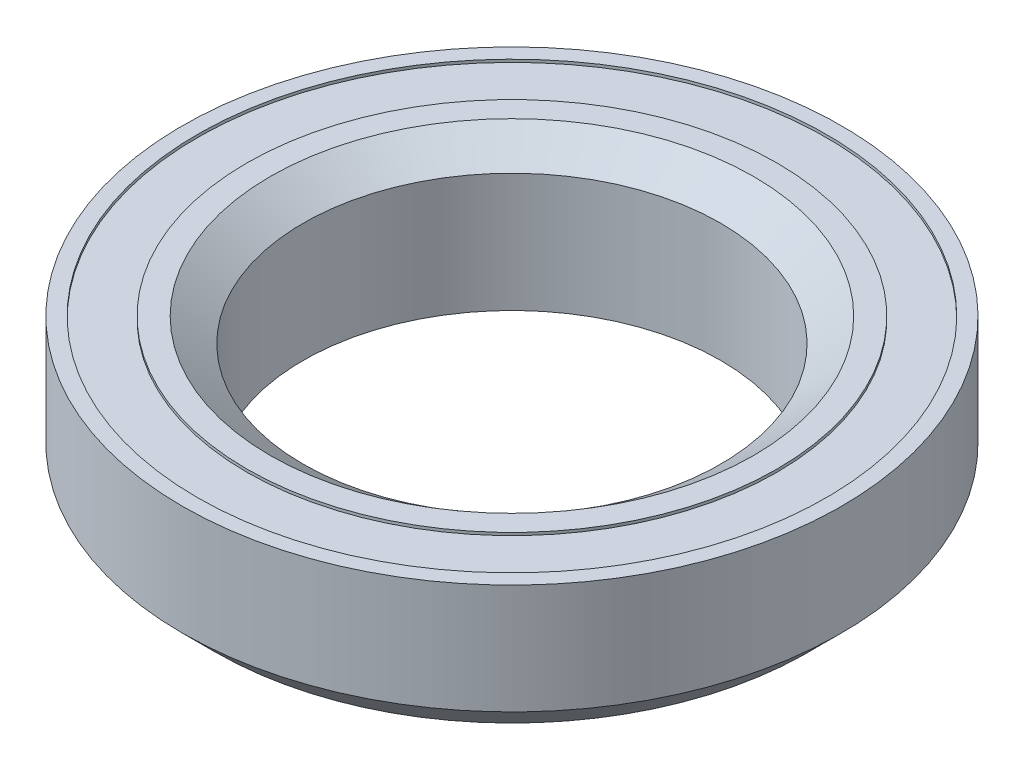
ISO-10303-21;
HEADER;
FILE_DESCRIPTION(('STEP AP214'),'2;1');
FILE_NAME('part.step','',(''),(''),'','','');
FILE_SCHEMA(('AUTOMOTIVE_DESIGN { 1 0 10303 214 1 1 1 1 }'));
ENDSEC;
DATA;
#1=APPLICATION_CONTEXT('core data for automotive mechanical design processes');
#2=APPLICATION_PROTOCOL_DEFINITION('international standard','automotive_design',2000,#1);
#3=PRODUCT_CONTEXT('',#1,'mechanical');
#4=PRODUCT('Part','Part','',(#3));
#5=PRODUCT_RELATED_PRODUCT_CATEGORY('part','',(#4));
#6=PRODUCT_DEFINITION_FORMATION('','',#4);
#7=PRODUCT_DEFINITION_CONTEXT('part definition',#1,'design');
#8=PRODUCT_DEFINITION('design','',#6,#7);
#9=PRODUCT_DEFINITION_SHAPE('','',#8);
#10=(LENGTH_UNIT() NAMED_UNIT(*) SI_UNIT(.MILLI.,.METRE.));
#11=(NAMED_UNIT(*) PLANE_ANGLE_UNIT() SI_UNIT($,.RADIAN.));
#12=(NAMED_UNIT(*) SI_UNIT($,.STERADIAN.) SOLID_ANGLE_UNIT());
#13=UNCERTAINTY_MEASURE_WITH_UNIT(LENGTH_MEASURE(1.E-05),#10,'distance_accuracy_value','');
#14=(GEOMETRIC_REPRESENTATION_CONTEXT(3) GLOBAL_UNCERTAINTY_ASSIGNED_CONTEXT((#13)) GLOBAL_UNIT_ASSIGNED_CONTEXT((#10,
#11,#12)) REPRESENTATION_CONTEXT('',''));
#15=CARTESIAN_POINT('',(0.,0.,0.));
#16=DIRECTION('',(0.,0.,1.));
#17=DIRECTION('',(1.,0.,0.));
#18=AXIS2_PLACEMENT_3D('',#15,#16,#17);
#19=CARTESIAN_POINT('',(0.,6.5,0.));
#20=DIRECTION('',(0.,1.,0.));
#21=DIRECTION('',(0.,0.,1.));
#22=AXIS2_PLACEMENT_3D('',#19,#20,#21);
#23=PLANE('',#22);
#24=CARTESIAN_POINT('',(0.,6.5,0.));
#25=DIRECTION('',(0.,1.,0.));
#26=DIRECTION('',(0.,0.,1.));
#27=AXIS2_PLACEMENT_3D('',#24,#25,#26);
#28=CIRCLE('',#27,11.);
#29=CARTESIAN_POINT('',(0.,6.5,11.));
#30=VERTEX_POINT('',#29);
#31=EDGE_CURVE('E10',#30,#30,#28,.F.);
#32=ORIENTED_EDGE('',*,*,#31,.T.);
#33=EDGE_LOOP('',(#32));
#34=FACE_BOUND('',#33,.T.);
#35=CARTESIAN_POINT('',(0.,6.5,0.));
#36=DIRECTION('',(0.,1.,0.));
#37=DIRECTION('',(0.,0.,1.));
#38=AXIS2_PLACEMENT_3D('',#35,#36,#37);
#39=CIRCLE('',#38,12.065);
#40=CARTESIAN_POINT('',(0.,6.5,12.065));
#41=VERTEX_POINT('',#40);
#42=EDGE_CURVE('E99',#41,#41,#39,.T.);
#43=ORIENTED_EDGE('',*,*,#42,.T.);
#44=EDGE_LOOP('',(#43));
#45=FACE_BOUND('',#44,.T.);
#46=ADVANCED_FACE('F41',(#34,#45),#23,.T.);
#47=CARTESIAN_POINT('',(0.,0.,0.));
#48=DIRECTION('',(0.,1.,0.));
#49=DIRECTION('',(0.,0.,1.));
#50=AXIS2_PLACEMENT_3D('',#47,#48,#49);
#51=PLANE('',#50);
#52=CARTESIAN_POINT('',(0.,0.,0.));
#53=DIRECTION('',(0.,1.,0.));
#54=DIRECTION('',(0.,0.,1.));
#55=AXIS2_PLACEMENT_3D('',#52,#53,#54);
#56=CIRCLE('',#55,9.5);
#57=CARTESIAN_POINT('',(0.,0.,9.5));
#58=VERTEX_POINT('',#57);
#59=EDGE_CURVE('E70',#58,#58,#56,.T.);
#60=ORIENTED_EDGE('',*,*,#59,.T.);
#61=EDGE_LOOP('',(#60));
#62=FACE_BOUND('',#61,.T.);
#63=CARTESIAN_POINT('',(0.,0.,0.));
#64=DIRECTION('',(0.,-1.,0.));
#65=DIRECTION('',(0.,0.,-1.));
#66=AXIS2_PLACEMENT_3D('',#63,#64,#65);
#67=CIRCLE('',#66,10.223184072359);
#68=CARTESIAN_POINT('',(0.,0.,-10.223184072359));
#69=VERTEX_POINT('',#68);
#70=EDGE_CURVE('E83',#69,#69,#67,.T.);
#71=ORIENTED_EDGE('',*,*,#70,.T.);
#72=EDGE_LOOP('',(#71));
#73=FACE_BOUND('',#72,.T.);
#74=ADVANCED_FACE('F131',(#62,#73),#51,.F.);
#75=CARTESIAN_POINT('',(0.,6.5,0.));
#76=DIRECTION('',(0.,-1.,0.));
#77=DIRECTION('',(0.,0.,-1.));
#78=AXIS2_PLACEMENT_3D('',#75,#76,#77);
#79=CYLINDRICAL_SURFACE('',#78,15.);
#80=CARTESIAN_POINT('',(0.,1.50000000000002,0.));
#81=DIRECTION('',(0.,1.,0.));
#82=DIRECTION('',(0.,0.,1.));
#83=AXIS2_PLACEMENT_3D('',#80,#81,#82);
#84=CIRCLE('',#83,15.);
#85=CARTESIAN_POINT('',(0.,1.50000000000002,15.));
#86=VERTEX_POINT('',#85);
#87=EDGE_CURVE('E60',#86,#86,#84,.T.);
#88=ORIENTED_EDGE('',*,*,#87,.T.);
#89=EDGE_LOOP('',(#88));
#90=FACE_BOUND('',#89,.T.);
#91=CARTESIAN_POINT('',(0.,6.5,0.));
#92=DIRECTION('',(0.,1.,0.));
#93=DIRECTION('',(0.,0.,1.));
#94=AXIS2_PLACEMENT_3D('',#91,#92,#93);
#95=CIRCLE('',#94,15.);
#96=CARTESIAN_POINT('',(0.,6.5,15.));
#97=VERTEX_POINT('',#96);
#98=EDGE_CURVE('E66',#97,#97,#95,.T.);
#99=ORIENTED_EDGE('',*,*,#98,.F.);
#100=EDGE_LOOP('',(#99));
#101=FACE_BOUND('',#100,.T.);
#102=ADVANCED_FACE('F126',(#90,#101),#79,.T.);
#103=CARTESIAN_POINT('',(0.,6.5,0.));
#104=DIRECTION('',(0.,1.,0.));
#105=DIRECTION('',(0.,0.,1.));
#106=AXIS2_PLACEMENT_3D('',#103,#104,#105);
#107=CIRCLE('',#106,14.3160340941404);
#108=CARTESIAN_POINT('',(0.,6.5,14.3160340941404));
#109=VERTEX_POINT('',#108);
#110=EDGE_CURVE('E91',#109,#109,#107,.T.);
#111=ORIENTED_EDGE('',*,*,#110,.F.);
#112=EDGE_LOOP('',(#111));
#113=FACE_BOUND('',#112,.T.);
#114=ORIENTED_EDGE('',*,*,#98,.T.);
#115=EDGE_LOOP('',(#114));
#116=FACE_BOUND('',#115,.T.);
#117=ADVANCED_FACE('F122',(#113,#116),#23,.T.);
#118=CARTESIAN_POINT('',(0.,0.,0.));
#119=DIRECTION('',(0.,-1.,0.));
#120=DIRECTION('',(0.,0.,-1.));
#121=AXIS2_PLACEMENT_3D('',#118,#119,#120);
#122=CIRCLE('',#121,12.8905);
#123=CARTESIAN_POINT('',(0.,0.,-12.8905));
#124=VERTEX_POINT('',#123);
#125=EDGE_CURVE('E75',#124,#124,#122,.T.);
#126=ORIENTED_EDGE('',*,*,#125,.F.);
#127=EDGE_LOOP('',(#126));
#128=FACE_BOUND('',#127,.T.);
#129=CARTESIAN_POINT('',(0.,0.,0.));
#130=DIRECTION('',(0.,1.,0.));
#131=DIRECTION('',(0.,0.,1.));
#132=AXIS2_PLACEMENT_3D('',#129,#130,#131);
#133=CIRCLE('',#132,13.5);
#134=CARTESIAN_POINT('',(0.,0.,13.5));
#135=VERTEX_POINT('',#134);
#136=EDGE_CURVE('E55',#135,#135,#133,.F.);
#137=ORIENTED_EDGE('',*,*,#136,.T.);
#138=EDGE_LOOP('',(#137));
#139=FACE_BOUND('',#138,.T.);
#140=ADVANCED_FACE('F125',(#128,#139),#51,.F.);
#141=CARTESIAN_POINT('',(0.,0.,0.));
#142=DIRECTION('',(0.,1.,0.));
#143=DIRECTION('',(0.,0.,1.));
#144=AXIS2_PLACEMENT_3D('',#141,#142,#143);
#145=CYLINDRICAL_SURFACE('',#144,9.5);
#146=CARTESIAN_POINT('',(0.,5.41018620799194,0.));
#147=DIRECTION('',(0.,1.,0.));
#148=DIRECTION('',(0.,0.,1.));
#149=AXIS2_PLACEMENT_3D('',#146,#147,#148);
#150=CIRCLE('',#149,9.5);
#151=CARTESIAN_POINT('',(0.,5.41018620799194,9.5));
#152=VERTEX_POINT('',#151);
#153=EDGE_CURVE('E49',#152,#152,#150,.T.);
#154=ORIENTED_EDGE('',*,*,#153,.T.);
#155=EDGE_LOOP('',(#154));
#156=FACE_BOUND('',#155,.T.);
#157=ORIENTED_EDGE('',*,*,#59,.F.);
#158=EDGE_LOOP('',(#157));
#159=FACE_BOUND('',#158,.T.);
#160=ADVANCED_FACE('F144',(#156,#159),#145,.F.);
#161=CARTESIAN_POINT('',(0.,1.50000000000002,0.));
#162=DIRECTION('',(0.,1.,0.));
#163=DIRECTION('',(0.,0.,1.));
#164=AXIS2_PLACEMENT_3D('',#161,#162,#163);
#165=CONICAL_SURFACE('',#164,15.,0.785398163397451);
#166=ORIENTED_EDGE('',*,*,#136,.F.);
#167=EDGE_LOOP('',(#166));
#168=FACE_BOUND('',#167,.T.);
#169=ORIENTED_EDGE('',*,*,#87,.F.);
#170=EDGE_LOOP('',(#169));
#171=FACE_BOUND('',#170,.T.);
#172=ADVANCED_FACE('F151',(#168,#171),#165,.T.);
#173=CARTESIAN_POINT('',(0.,5.41018620799194,0.));
#174=DIRECTION('',(0.,1.,0.));
#175=DIRECTION('',(0.,0.,1.));
#176=AXIS2_PLACEMENT_3D('',#173,#174,#175);
#177=CONICAL_SURFACE('',#176,9.5,0.942477796076941);
#178=ORIENTED_EDGE('',*,*,#31,.F.);
#179=EDGE_LOOP('',(#178));
#180=FACE_BOUND('',#179,.T.);
#181=ORIENTED_EDGE('',*,*,#153,.F.);
#182=EDGE_LOOP('',(#181));
#183=FACE_BOUND('',#182,.T.);
#184=ADVANCED_FACE('F43',(#180,#183),#177,.F.);
#185=CARTESIAN_POINT('',(0.,0.127,0.));
#186=DIRECTION('',(0.,-1.,0.));
#187=DIRECTION('',(0.,0.,-1.));
#188=AXIS2_PLACEMENT_3D('',#185,#186,#187);
#189=CYLINDRICAL_SURFACE('',#188,12.8905);
#190=CARTESIAN_POINT('',(0.,0.127,0.));
#191=DIRECTION('',(0.,-1.,0.));
#192=DIRECTION('',(0.,0.,-1.));
#193=AXIS2_PLACEMENT_3D('',#190,#191,#192);
#194=CIRCLE('',#193,12.8905);
#195=CARTESIAN_POINT('',(0.,0.127,-12.8905));
#196=VERTEX_POINT('',#195);
#197=EDGE_CURVE('E74',#196,#196,#194,.T.);
#198=ORIENTED_EDGE('',*,*,#197,.F.);
#199=EDGE_LOOP('',(#198));
#200=FACE_BOUND('',#199,.T.);
#201=ORIENTED_EDGE('',*,*,#125,.T.);
#202=EDGE_LOOP('',(#201));
#203=FACE_BOUND('',#202,.T.);
#204=ADVANCED_FACE('F162',(#200,#203),#189,.F.);
#205=CARTESIAN_POINT('',(0.,0.127,0.));
#206=DIRECTION('',(0.,-1.,0.));
#207=DIRECTION('',(0.,0.,-1.));
#208=AXIS2_PLACEMENT_3D('',#205,#206,#207);
#209=PLANE('',#208);
#210=CARTESIAN_POINT('',(0.,0.127,0.));
#211=DIRECTION('',(0.,-1.,0.));
#212=DIRECTION('',(0.,0.,-1.));
#213=AXIS2_PLACEMENT_3D('',#210,#211,#212);
#214=CIRCLE('',#213,10.223184072359);
#215=CARTESIAN_POINT('',(0.,0.127,-10.223184072359));
#216=VERTEX_POINT('',#215);
#217=EDGE_CURVE('E79',#216,#216,#214,.T.);
#218=ORIENTED_EDGE('',*,*,#217,.F.);
#219=EDGE_LOOP('',(#218));
#220=FACE_BOUND('',#219,.T.);
#221=ORIENTED_EDGE('',*,*,#197,.T.);
#222=EDGE_LOOP('',(#221));
#223=FACE_BOUND('',#222,.T.);
#224=ADVANCED_FACE('F167',(#220,#223),#209,.T.);
#225=CARTESIAN_POINT('',(0.,0.127,0.));
#226=DIRECTION('',(0.,-1.,0.));
#227=DIRECTION('',(0.,0.,-1.));
#228=AXIS2_PLACEMENT_3D('',#225,#226,#227);
#229=CYLINDRICAL_SURFACE('',#228,10.223184072359);
#230=ORIENTED_EDGE('',*,*,#217,.T.);
#231=EDGE_LOOP('',(#230));
#232=FACE_BOUND('',#231,.T.);
#233=ORIENTED_EDGE('',*,*,#70,.F.);
#234=EDGE_LOOP('',(#233));
#235=FACE_BOUND('',#234,.T.);
#236=ADVANCED_FACE('F118',(#232,#235),#229,.T.);
#237=CARTESIAN_POINT('',(0.,6.373,0.));
#238=DIRECTION('',(0.,1.,0.));
#239=DIRECTION('',(0.,0.,1.));
#240=AXIS2_PLACEMENT_3D('',#237,#238,#239);
#241=CYLINDRICAL_SURFACE('',#240,14.3160340941404);
#242=CARTESIAN_POINT('',(0.,6.373,0.));
#243=DIRECTION('',(0.,1.,0.));
#244=DIRECTION('',(0.,0.,1.));
#245=AXIS2_PLACEMENT_3D('',#242,#243,#244);
#246=CIRCLE('',#245,14.3160340941404);
#247=CARTESIAN_POINT('',(0.,6.373,14.3160340941404));
#248=VERTEX_POINT('',#247);
#249=EDGE_CURVE('E87',#248,#248,#246,.T.);
#250=ORIENTED_EDGE('',*,*,#249,.F.);
#251=EDGE_LOOP('',(#250));
#252=FACE_BOUND('',#251,.T.);
#253=ORIENTED_EDGE('',*,*,#110,.T.);
#254=EDGE_LOOP('',(#253));
#255=FACE_BOUND('',#254,.T.);
#256=ADVANCED_FACE('F112',(#252,#255),#241,.F.);
#257=CARTESIAN_POINT('',(0.,6.373,0.));
#258=DIRECTION('',(0.,1.,0.));
#259=DIRECTION('',(0.,0.,1.));
#260=AXIS2_PLACEMENT_3D('',#257,#258,#259);
#261=PLANE('',#260);
#262=CARTESIAN_POINT('',(0.,6.373,0.));
#263=DIRECTION('',(0.,1.,0.));
#264=DIRECTION('',(0.,0.,1.));
#265=AXIS2_PLACEMENT_3D('',#262,#263,#264);
#266=CIRCLE('',#265,12.065);
#267=CARTESIAN_POINT('',(0.,6.373,12.065));
#268=VERTEX_POINT('',#267);
#269=EDGE_CURVE('E95',#268,#268,#266,.T.);
#270=ORIENTED_EDGE('',*,*,#269,.F.);
#271=EDGE_LOOP('',(#270));
#272=FACE_BOUND('',#271,.T.);
#273=ORIENTED_EDGE('',*,*,#249,.T.);
#274=EDGE_LOOP('',(#273));
#275=FACE_BOUND('',#274,.T.);
#276=ADVANCED_FACE('F109',(#272,#275),#261,.T.);
#277=CARTESIAN_POINT('',(0.,6.373,0.));
#278=DIRECTION('',(0.,1.,0.));
#279=DIRECTION('',(0.,0.,1.));
#280=AXIS2_PLACEMENT_3D('',#277,#278,#279);
#281=CYLINDRICAL_SURFACE('',#280,12.065);
#282=ORIENTED_EDGE('',*,*,#269,.T.);
#283=EDGE_LOOP('',(#282));
#284=FACE_BOUND('',#283,.T.);
#285=ORIENTED_EDGE('',*,*,#42,.F.);
#286=EDGE_LOOP('',(#285));
#287=FACE_BOUND('',#286,.T.);
#288=ADVANCED_FACE('F106',(#284,#287),#281,.T.);
#289=CLOSED_SHELL('',(#46,#74,#102,#117,#140,#160,#172,#184,#204,#224,#236,#256,#276,#288));
#290=MANIFOLD_SOLID_BREP('B2',#289);
#291=ADVANCED_BREP_SHAPE_REPRESENTATION('',(#18,#290),#14);
#292=SHAPE_DEFINITION_REPRESENTATION(#9,#291);
ENDSEC;
END-ISO-10303-21;
